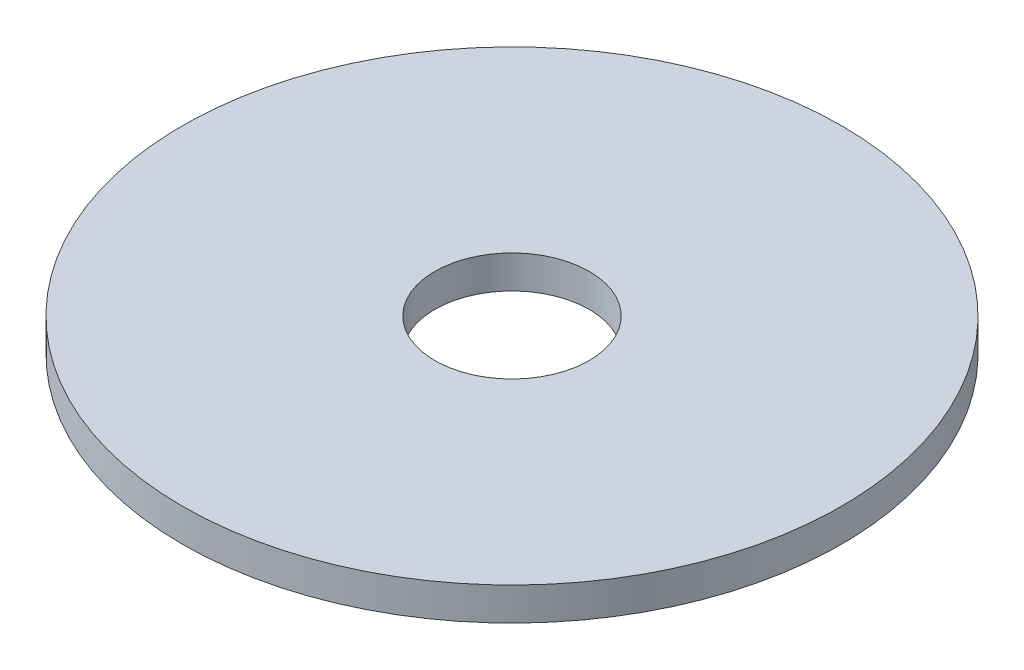
ISO-10303-21;
HEADER;
FILE_DESCRIPTION(('STEP AP214'),'2;1');
FILE_NAME('part.step','',(''),(''),'','','');
FILE_SCHEMA(('AUTOMOTIVE_DESIGN { 1 0 10303 214 1 1 1 1 }'));
ENDSEC;
DATA;
#1=APPLICATION_CONTEXT('core data for automotive mechanical design processes');
#2=APPLICATION_PROTOCOL_DEFINITION('international standard','automotive_design',2000,#1);
#3=PRODUCT_CONTEXT('',#1,'mechanical');
#4=PRODUCT('Part','Part','',(#3));
#5=PRODUCT_RELATED_PRODUCT_CATEGORY('part','',(#4));
#6=PRODUCT_DEFINITION_FORMATION('','',#4);
#7=PRODUCT_DEFINITION_CONTEXT('part definition',#1,'design');
#8=PRODUCT_DEFINITION('design','',#6,#7);
#9=PRODUCT_DEFINITION_SHAPE('','',#8);
#10=(LENGTH_UNIT() NAMED_UNIT(*) SI_UNIT(.MILLI.,.METRE.));
#11=(NAMED_UNIT(*) PLANE_ANGLE_UNIT() SI_UNIT($,.RADIAN.));
#12=(NAMED_UNIT(*) SI_UNIT($,.STERADIAN.) SOLID_ANGLE_UNIT());
#13=UNCERTAINTY_MEASURE_WITH_UNIT(LENGTH_MEASURE(1.E-05),#10,'distance_accuracy_value','');
#14=(GEOMETRIC_REPRESENTATION_CONTEXT(3) GLOBAL_UNCERTAINTY_ASSIGNED_CONTEXT((#13)) GLOBAL_UNIT_ASSIGNED_CONTEXT((#10,
#11,#12)) REPRESENTATION_CONTEXT('',''));
#15=CARTESIAN_POINT('',(0.,0.,0.));
#16=DIRECTION('',(0.,0.,1.));
#17=DIRECTION('',(1.,0.,0.));
#18=AXIS2_PLACEMENT_3D('',#15,#16,#17);
#19=CARTESIAN_POINT('',(0.,0.,0.));
#20=DIRECTION('',(0.,-1.,0.));
#21=DIRECTION('',(0.,0.,-1.));
#22=AXIS2_PLACEMENT_3D('',#19,#20,#21);
#23=CYLINDRICAL_SURFACE('',#22,16.);
#24=CARTESIAN_POINT('',(0.,0.,0.));
#25=DIRECTION('',(0.,-1.,0.));
#26=DIRECTION('',(0.,0.,-1.));
#27=AXIS2_PLACEMENT_3D('',#24,#25,#26);
#28=CIRCLE('',#27,16.);
#29=CARTESIAN_POINT('',(0.,0.,-16.));
#30=VERTEX_POINT('',#29);
#31=EDGE_CURVE('E26',#30,#30,#28,.T.);
#32=ORIENTED_EDGE('',*,*,#31,.F.);
#33=EDGE_LOOP('',(#32));
#34=FACE_BOUND('',#33,.T.);
#35=CARTESIAN_POINT('',(0.,1.6,0.));
#36=DIRECTION('',(0.,-1.,0.));
#37=DIRECTION('',(0.,0.,-1.));
#38=AXIS2_PLACEMENT_3D('',#35,#36,#37);
#39=CIRCLE('',#38,16.);
#40=CARTESIAN_POINT('',(0.,1.6,-16.));
#41=VERTEX_POINT('',#40);
#42=EDGE_CURVE('E17',#41,#41,#39,.F.);
#43=ORIENTED_EDGE('',*,*,#42,.F.);
#44=EDGE_LOOP('',(#43));
#45=FACE_BOUND('',#44,.T.);
#46=ADVANCED_FACE('F14',(#34,#45),#23,.T.);
#47=CARTESIAN_POINT('',(0.,1.6,0.));
#48=DIRECTION('',(0.,1.,0.));
#49=DIRECTION('',(0.,0.,1.));
#50=AXIS2_PLACEMENT_3D('',#47,#48,#49);
#51=PLANE('',#50);
#52=CARTESIAN_POINT('',(0.,1.6,0.));
#53=DIRECTION('',(0.,-1.,0.));
#54=DIRECTION('',(0.,0.,-1.));
#55=AXIS2_PLACEMENT_3D('',#52,#53,#54);
#56=CIRCLE('',#55,3.75);
#57=CARTESIAN_POINT('',(0.,1.6,-3.75));
#58=VERTEX_POINT('',#57);
#59=EDGE_CURVE('E21',#58,#58,#56,.F.);
#60=ORIENTED_EDGE('',*,*,#59,.F.);
#61=EDGE_LOOP('',(#60));
#62=FACE_BOUND('',#61,.T.);
#63=ORIENTED_EDGE('',*,*,#42,.T.);
#64=EDGE_LOOP('',(#63));
#65=FACE_BOUND('',#64,.T.);
#66=ADVANCED_FACE('F34',(#62,#65),#51,.T.);
#67=CARTESIAN_POINT('',(0.,0.,0.));
#68=DIRECTION('',(0.,1.,0.));
#69=DIRECTION('',(0.,0.,1.));
#70=AXIS2_PLACEMENT_3D('',#67,#68,#69);
#71=PLANE('',#70);
#72=CARTESIAN_POINT('',(0.,0.,0.));
#73=DIRECTION('',(0.,-1.,0.));
#74=DIRECTION('',(0.,0.,-1.));
#75=AXIS2_PLACEMENT_3D('',#72,#73,#74);
#76=CIRCLE('',#75,3.75);
#77=CARTESIAN_POINT('',(0.,0.,-3.75));
#78=VERTEX_POINT('',#77);
#79=EDGE_CURVE('E10',#78,#78,#76,.T.);
#80=ORIENTED_EDGE('',*,*,#79,.F.);
#81=EDGE_LOOP('',(#80));
#82=FACE_BOUND('',#81,.T.);
#83=ORIENTED_EDGE('',*,*,#31,.T.);
#84=EDGE_LOOP('',(#83));
#85=FACE_BOUND('',#84,.T.);
#86=ADVANCED_FACE('F42',(#82,#85),#71,.F.);
#87=CARTESIAN_POINT('',(0.,1.6,0.));
#88=DIRECTION('',(0.,-1.,0.));
#89=DIRECTION('',(0.,0.,-1.));
#90=AXIS2_PLACEMENT_3D('',#87,#88,#89);
#91=CYLINDRICAL_SURFACE('',#90,3.75);
#92=ORIENTED_EDGE('',*,*,#59,.T.);
#93=EDGE_LOOP('',(#92));
#94=FACE_BOUND('',#93,.T.);
#95=ORIENTED_EDGE('',*,*,#79,.T.);
#96=EDGE_LOOP('',(#95));
#97=FACE_BOUND('',#96,.T.);
#98=ADVANCED_FACE('F44',(#94,#97),#91,.F.);
#99=CLOSED_SHELL('',(#46,#66,#86,#98));
#100=MANIFOLD_SOLID_BREP('B1',#99);
#101=ADVANCED_BREP_SHAPE_REPRESENTATION('',(#18,#100),#14);
#102=SHAPE_DEFINITION_REPRESENTATION(#9,#101);
ENDSEC;
END-ISO-10303-21;
